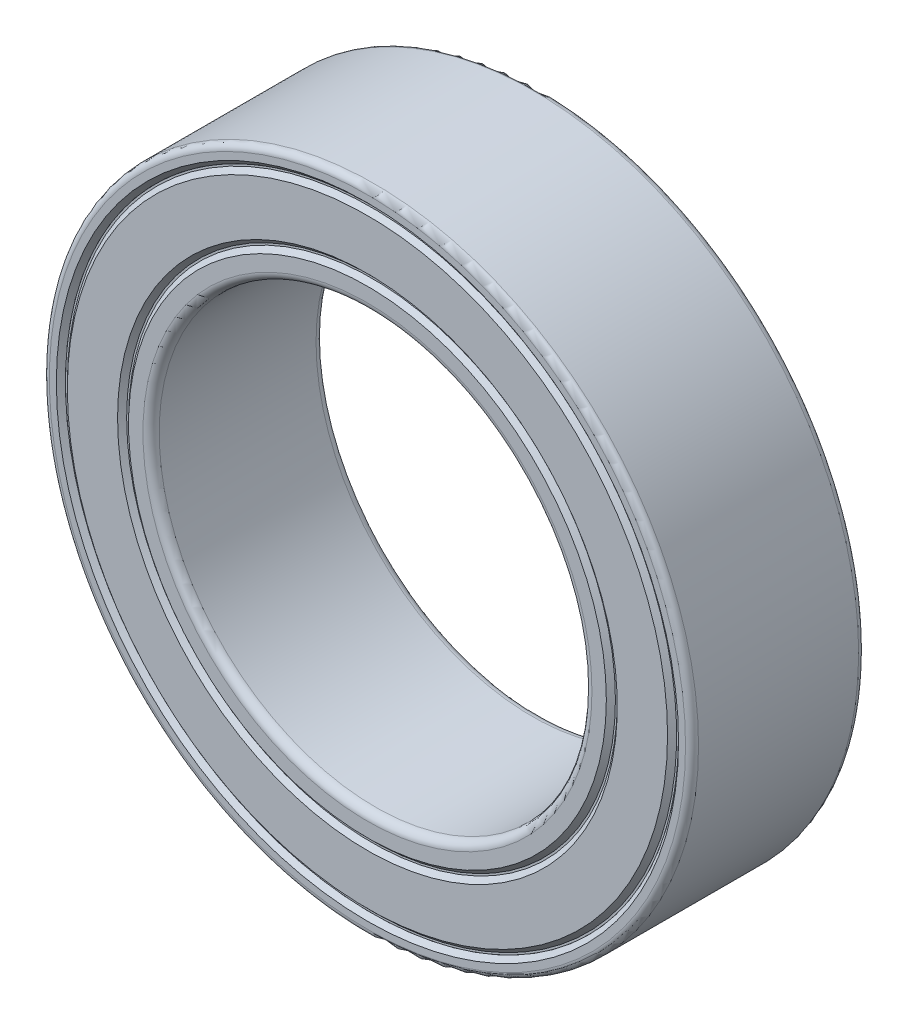
ISO-10303-21;
HEADER;
FILE_DESCRIPTION(('STEP AP214'),'2;1');
FILE_NAME('part.step','',(''),(''),'','','');
FILE_SCHEMA(('AUTOMOTIVE_DESIGN { 1 0 10303 214 1 1 1 1 }'));
ENDSEC;
DATA;
#1=APPLICATION_CONTEXT('core data for automotive mechanical design processes');
#2=APPLICATION_PROTOCOL_DEFINITION('international standard','automotive_design',2000,#1);
#3=PRODUCT_CONTEXT('',#1,'mechanical');
#4=PRODUCT('Part','Part','',(#3));
#5=PRODUCT_RELATED_PRODUCT_CATEGORY('part','',(#4));
#6=PRODUCT_DEFINITION_FORMATION('','',#4);
#7=PRODUCT_DEFINITION_CONTEXT('part definition',#1,'design');
#8=PRODUCT_DEFINITION('design','',#6,#7);
#9=PRODUCT_DEFINITION_SHAPE('','',#8);
#10=(LENGTH_UNIT() NAMED_UNIT(*) SI_UNIT(.MILLI.,.METRE.));
#11=(NAMED_UNIT(*) PLANE_ANGLE_UNIT() SI_UNIT($,.RADIAN.));
#12=(NAMED_UNIT(*) SI_UNIT($,.STERADIAN.) SOLID_ANGLE_UNIT());
#13=UNCERTAINTY_MEASURE_WITH_UNIT(LENGTH_MEASURE(1.E-05),#10,'distance_accuracy_value','');
#14=(GEOMETRIC_REPRESENTATION_CONTEXT(3) GLOBAL_UNCERTAINTY_ASSIGNED_CONTEXT((#13)) GLOBAL_UNIT_ASSIGNED_CONTEXT((#10,
#11,#12)) REPRESENTATION_CONTEXT('',''));
#15=CARTESIAN_POINT('',(0.,0.,0.));
#16=DIRECTION('',(0.,0.,1.));
#17=DIRECTION('',(1.,0.,0.));
#18=AXIS2_PLACEMENT_3D('',#15,#16,#17);
#19=CARTESIAN_POINT('',(0.,0.,-1.895));
#20=DIRECTION('',(0.,0.,-1.));
#21=DIRECTION('',(1.,0.,0.));
#22=AXIS2_PLACEMENT_3D('',#19,#20,#21);
#23=CYLINDRICAL_SURFACE('',#22,5.625);
#24=CARTESIAN_POINT('',(0.,0.,-1.895));
#25=DIRECTION('',(0.,0.,-1.));
#26=DIRECTION('',(-1.,0.,0.));
#27=AXIS2_PLACEMENT_3D('',#24,#25,#26);
#28=CIRCLE('',#27,5.625);
#29=CARTESIAN_POINT('',(-5.625,0.,-1.895));
#30=VERTEX_POINT('',#29);
#31=EDGE_CURVE('E77',#30,#30,#28,.T.);
#32=ORIENTED_EDGE('',*,*,#31,.T.);
#33=EDGE_LOOP('',(#32));
#34=FACE_BOUND('',#33,.T.);
#35=CARTESIAN_POINT('',(0.,0.,-1.768));
#36=DIRECTION('',(0.,0.,-1.));
#37=DIRECTION('',(-1.,0.,0.));
#38=AXIS2_PLACEMENT_3D('',#35,#36,#37);
#39=CIRCLE('',#38,5.625);
#40=CARTESIAN_POINT('',(-5.625,0.,-1.768));
#41=VERTEX_POINT('',#40);
#42=EDGE_CURVE('E46',#41,#41,#39,.T.);
#43=ORIENTED_EDGE('',*,*,#42,.F.);
#44=EDGE_LOOP('',(#43));
#45=FACE_BOUND('',#44,.T.);
#46=ADVANCED_FACE('F43',(#34,#45),#23,.F.);
#47=CARTESIAN_POINT('',(0.,0.,-1.895));
#48=DIRECTION('',(0.,0.,-1.));
#49=DIRECTION('',(1.,0.,0.));
#50=AXIS2_PLACEMENT_3D('',#47,#48,#49);
#51=CYLINDRICAL_SURFACE('',#50,7.08333333333333);
#52=CARTESIAN_POINT('',(0.,0.,-1.895));
#53=DIRECTION('',(0.,0.,-1.));
#54=DIRECTION('',(-1.,0.,0.));
#55=AXIS2_PLACEMENT_3D('',#52,#53,#54);
#56=CIRCLE('',#55,7.08333333333333);
#57=CARTESIAN_POINT('',(-7.08333333333333,0.,-1.895));
#58=VERTEX_POINT('',#57);
#59=EDGE_CURVE('E11',#58,#58,#56,.T.);
#60=ORIENTED_EDGE('',*,*,#59,.F.);
#61=EDGE_LOOP('',(#60));
#62=FACE_BOUND('',#61,.T.);
#63=CARTESIAN_POINT('',(0.,0.,-1.768));
#64=DIRECTION('',(0.,0.,-1.));
#65=DIRECTION('',(-1.,0.,0.));
#66=AXIS2_PLACEMENT_3D('',#63,#64,#65);
#67=CIRCLE('',#66,7.08333333333333);
#68=CARTESIAN_POINT('',(-7.08333333333333,0.,-1.768));
#69=VERTEX_POINT('',#68);
#70=EDGE_CURVE('E63',#69,#69,#67,.T.);
#71=ORIENTED_EDGE('',*,*,#70,.T.);
#72=EDGE_LOOP('',(#71));
#73=FACE_BOUND('',#72,.T.);
#74=ADVANCED_FACE('F100',(#62,#73),#51,.T.);
#75=CARTESIAN_POINT('',(0.,-7.03958333333333,-1.895));
#76=DIRECTION('',(0.,0.,-1.));
#77=DIRECTION('',(1.,0.,0.));
#78=AXIS2_PLACEMENT_3D('',#75,#76,#77);
#79=PLANE('',#78);
#80=CARTESIAN_POINT('',(0.,0.,-1.895));
#81=DIRECTION('',(0.,0.,-1.));
#82=DIRECTION('',(-1.,0.,0.));
#83=AXIS2_PLACEMENT_3D('',#80,#81,#82);
#84=CIRCLE('',#83,7.03958333333333);
#85=CARTESIAN_POINT('',(-7.03958333333333,0.,-1.895));
#86=VERTEX_POINT('',#85);
#87=EDGE_CURVE('E50',#86,#86,#84,.T.);
#88=ORIENTED_EDGE('',*,*,#87,.F.);
#89=EDGE_LOOP('',(#88));
#90=FACE_BOUND('',#89,.T.);
#91=ORIENTED_EDGE('',*,*,#59,.T.);
#92=EDGE_LOOP('',(#91));
#93=FACE_BOUND('',#92,.T.);
#94=ADVANCED_FACE('F95',(#90,#93),#79,.T.);
#95=CARTESIAN_POINT('',(0.,0.,-1.895));
#96=DIRECTION('',(0.,0.,1.));
#97=DIRECTION('',(-1.,0.,0.));
#98=AXIS2_PLACEMENT_3D('',#95,#96,#97);
#99=CONICAL_SURFACE('',#98,7.03958333333333,0.785398163397448);
#100=CARTESIAN_POINT('',(0.,0.,-2.));
#101=DIRECTION('',(0.,0.,-1.));
#102=DIRECTION('',(-1.,0.,0.));
#103=AXIS2_PLACEMENT_3D('',#100,#101,#102);
#104=CIRCLE('',#103,6.93458333333333);
#105=CARTESIAN_POINT('',(-6.93458333333333,0.,-2.));
#106=VERTEX_POINT('',#105);
#107=EDGE_CURVE('E55',#106,#106,#104,.T.);
#108=ORIENTED_EDGE('',*,*,#107,.F.);
#109=EDGE_LOOP('',(#108));
#110=FACE_BOUND('',#109,.T.);
#111=ORIENTED_EDGE('',*,*,#87,.T.);
#112=EDGE_LOOP('',(#111));
#113=FACE_BOUND('',#112,.T.);
#114=ADVANCED_FACE('F92',(#110,#113),#99,.T.);
#115=CARTESIAN_POINT('',(0.,-5.77375000000001,-2.));
#116=DIRECTION('',(0.,0.,-1.));
#117=DIRECTION('',(1.,0.,0.));
#118=AXIS2_PLACEMENT_3D('',#115,#116,#117);
#119=PLANE('',#118);
#120=CARTESIAN_POINT('',(0.,0.,-2.));
#121=DIRECTION('',(0.,0.,-1.));
#122=DIRECTION('',(-1.,0.,0.));
#123=AXIS2_PLACEMENT_3D('',#120,#121,#122);
#124=CIRCLE('',#123,5.77375000000001);
#125=CARTESIAN_POINT('',(-5.77375000000001,0.,-2.));
#126=VERTEX_POINT('',#125);
#127=EDGE_CURVE('E82',#126,#126,#124,.T.);
#128=ORIENTED_EDGE('',*,*,#127,.F.);
#129=EDGE_LOOP('',(#128));
#130=FACE_BOUND('',#129,.T.);
#131=ORIENTED_EDGE('',*,*,#107,.T.);
#132=EDGE_LOOP('',(#131));
#133=FACE_BOUND('',#132,.T.);
#134=ADVANCED_FACE('F90',(#130,#133),#119,.T.);
#135=CARTESIAN_POINT('',(0.,0.,-2.));
#136=DIRECTION('',(0.,0.,-1.));
#137=DIRECTION('',(1.,0.,0.));
#138=AXIS2_PLACEMENT_3D('',#135,#136,#137);
#139=CONICAL_SURFACE('',#138,5.77375000000001,0.785398163397457);
#140=CARTESIAN_POINT('',(0.,0.,-1.895));
#141=DIRECTION('',(0.,0.,-1.));
#142=DIRECTION('',(-1.,0.,0.));
#143=AXIS2_PLACEMENT_3D('',#140,#141,#142);
#144=CIRCLE('',#143,5.66875);
#145=CARTESIAN_POINT('',(-5.66875,0.,-1.895));
#146=VERTEX_POINT('',#145);
#147=EDGE_CURVE('E73',#146,#146,#144,.T.);
#148=ORIENTED_EDGE('',*,*,#147,.F.);
#149=EDGE_LOOP('',(#148));
#150=FACE_BOUND('',#149,.T.);
#151=ORIENTED_EDGE('',*,*,#127,.T.);
#152=EDGE_LOOP('',(#151));
#153=FACE_BOUND('',#152,.T.);
#154=ADVANCED_FACE('F147',(#150,#153),#139,.F.);
#155=CARTESIAN_POINT('',(0.,-5.66875,-1.895));
#156=DIRECTION('',(0.,0.,-1.));
#157=DIRECTION('',(1.,0.,0.));
#158=AXIS2_PLACEMENT_3D('',#155,#156,#157);
#159=PLANE('',#158);
#160=ORIENTED_EDGE('',*,*,#31,.F.);
#161=EDGE_LOOP('',(#160));
#162=FACE_BOUND('',#161,.T.);
#163=ORIENTED_EDGE('',*,*,#147,.T.);
#164=EDGE_LOOP('',(#163));
#165=FACE_BOUND('',#164,.T.);
#166=ADVANCED_FACE('F143',(#162,#165),#159,.T.);
#167=CARTESIAN_POINT('',(0.,-7.03958333333333,-1.768));
#168=DIRECTION('',(0.,0.,-1.));
#169=DIRECTION('',(1.,0.,0.));
#170=AXIS2_PLACEMENT_3D('',#167,#168,#169);
#171=PLANE('',#170);
#172=CARTESIAN_POINT('',(0.,0.,-1.768));
#173=DIRECTION('',(0.,0.,1.));
#174=DIRECTION('',(1.,0.,0.));
#175=AXIS2_PLACEMENT_3D('',#172,#173,#174);
#176=CIRCLE('',#175,6.98697821091195);
#177=CARTESIAN_POINT('',(6.98697821091195,0.,-1.768));
#178=VERTEX_POINT('',#177);
#179=EDGE_CURVE('E60',#178,#178,#176,.F.);
#180=ORIENTED_EDGE('',*,*,#179,.T.);
#181=EDGE_LOOP('',(#180));
#182=FACE_BOUND('',#181,.T.);
#183=ORIENTED_EDGE('',*,*,#70,.F.);
#184=EDGE_LOOP('',(#183));
#185=FACE_BOUND('',#184,.T.);
#186=ADVANCED_FACE('F137',(#182,#185),#171,.F.);
#187=CARTESIAN_POINT('',(0.,0.,-1.8051974387893));
#188=DIRECTION('',(0.,0.,1.));
#189=DIRECTION('',(-1.,0.,0.));
#190=AXIS2_PLACEMENT_3D('',#187,#188,#189);
#191=CONICAL_SURFACE('',#190,6.94978077212264,0.785398163397448);
#192=CARTESIAN_POINT('',(0.,0.,-1.873));
#193=DIRECTION('',(0.,0.,1.));
#194=DIRECTION('',(1.,0.,0.));
#195=AXIS2_PLACEMENT_3D('',#192,#193,#194);
#196=CIRCLE('',#195,6.88197821091194);
#197=CARTESIAN_POINT('',(6.88197821091194,0.,-1.873));
#198=VERTEX_POINT('',#197);
#199=EDGE_CURVE('E64',#198,#198,#196,.F.);
#200=ORIENTED_EDGE('',*,*,#199,.T.);
#201=EDGE_LOOP('',(#200));
#202=FACE_BOUND('',#201,.T.);
#203=ORIENTED_EDGE('',*,*,#179,.F.);
#204=EDGE_LOOP('',(#203));
#205=FACE_BOUND('',#204,.T.);
#206=ADVANCED_FACE('F131',(#202,#205),#191,.F.);
#207=CARTESIAN_POINT('',(0.,-5.77375000000001,-1.873));
#208=DIRECTION('',(0.,0.,-1.));
#209=DIRECTION('',(1.,0.,0.));
#210=AXIS2_PLACEMENT_3D('',#207,#208,#209);
#211=PLANE('',#210);
#212=CARTESIAN_POINT('',(0.,0.,-1.873));
#213=DIRECTION('',(0.,0.,1.));
#214=DIRECTION('',(1.,0.,0.));
#215=AXIS2_PLACEMENT_3D('',#212,#213,#214);
#216=CIRCLE('',#215,5.82635512242139);
#217=CARTESIAN_POINT('',(5.82635512242139,0.,-1.873));
#218=VERTEX_POINT('',#217);
#219=EDGE_CURVE('E67',#218,#218,#216,.F.);
#220=ORIENTED_EDGE('',*,*,#219,.T.);
#221=EDGE_LOOP('',(#220));
#222=FACE_BOUND('',#221,.T.);
#223=ORIENTED_EDGE('',*,*,#199,.F.);
#224=EDGE_LOOP('',(#223));
#225=FACE_BOUND('',#224,.T.);
#226=ADVANCED_FACE('F125',(#222,#225),#211,.F.);
#227=CARTESIAN_POINT('',(0.,0.,-1.91019743878931));
#228=DIRECTION('',(0.,0.,-1.));
#229=DIRECTION('',(1.,0.,0.));
#230=AXIS2_PLACEMENT_3D('',#227,#228,#229);
#231=CONICAL_SURFACE('',#230,5.8635525612107,0.785398163397457);
#232=CARTESIAN_POINT('',(0.,0.,-1.768));
#233=DIRECTION('',(0.,0.,1.));
#234=DIRECTION('',(1.,0.,0.));
#235=AXIS2_PLACEMENT_3D('',#232,#233,#234);
#236=CIRCLE('',#235,5.72135512242138);
#237=CARTESIAN_POINT('',(5.72135512242138,0.,-1.768));
#238=VERTEX_POINT('',#237);
#239=EDGE_CURVE('E70',#238,#238,#236,.F.);
#240=ORIENTED_EDGE('',*,*,#239,.T.);
#241=EDGE_LOOP('',(#240));
#242=FACE_BOUND('',#241,.T.);
#243=ORIENTED_EDGE('',*,*,#219,.F.);
#244=EDGE_LOOP('',(#243));
#245=FACE_BOUND('',#244,.T.);
#246=ADVANCED_FACE('F119',(#242,#245),#231,.T.);
#247=CARTESIAN_POINT('',(0.,-5.66875,-1.768));
#248=DIRECTION('',(0.,0.,-1.));
#249=DIRECTION('',(1.,0.,0.));
#250=AXIS2_PLACEMENT_3D('',#247,#248,#249);
#251=PLANE('',#250);
#252=ORIENTED_EDGE('',*,*,#42,.T.);
#253=EDGE_LOOP('',(#252));
#254=FACE_BOUND('',#253,.T.);
#255=ORIENTED_EDGE('',*,*,#239,.F.);
#256=EDGE_LOOP('',(#255));
#257=FACE_BOUND('',#256,.T.);
#258=ADVANCED_FACE('F116',(#254,#257),#251,.F.);
#259=CLOSED_SHELL('',(#46,#74,#94,#114,#134,#154,#166,#186,#206,#226,#246,#258));
#260=MANIFOLD_SOLID_BREP('B2',#259);
#261=CARTESIAN_POINT('',(0.,0.,1.895));
#262=DIRECTION('',(0.,0.,1.));
#263=DIRECTION('',(1.,0.,0.));
#264=AXIS2_PLACEMENT_3D('',#261,#262,#263);
#265=CYLINDRICAL_SURFACE('',#264,5.625);
#266=CARTESIAN_POINT('',(0.,0.,1.895));
#267=DIRECTION('',(0.,0.,-1.));
#268=DIRECTION('',(-1.,0.,0.));
#269=AXIS2_PLACEMENT_3D('',#266,#267,#268);
#270=CIRCLE('',#269,5.625);
#271=CARTESIAN_POINT('',(-5.625,0.,1.895));
#272=VERTEX_POINT('',#271);
#273=EDGE_CURVE('E264',#272,#272,#270,.T.);
#274=ORIENTED_EDGE('',*,*,#273,.F.);
#275=EDGE_LOOP('',(#274));
#276=FACE_BOUND('',#275,.T.);
#277=CARTESIAN_POINT('',(0.,0.,1.768));
#278=DIRECTION('',(0.,0.,-1.));
#279=DIRECTION('',(-1.,0.,0.));
#280=AXIS2_PLACEMENT_3D('',#277,#278,#279);
#281=CIRCLE('',#280,5.625);
#282=CARTESIAN_POINT('',(-5.625,0.,1.768));
#283=VERTEX_POINT('',#282);
#284=EDGE_CURVE('E233',#283,#283,#281,.T.);
#285=ORIENTED_EDGE('',*,*,#284,.T.);
#286=EDGE_LOOP('',(#285));
#287=FACE_BOUND('',#286,.T.);
#288=ADVANCED_FACE('F230',(#276,#287),#265,.F.);
#289=CARTESIAN_POINT('',(0.,0.,1.895));
#290=DIRECTION('',(0.,0.,1.));
#291=DIRECTION('',(1.,0.,0.));
#292=AXIS2_PLACEMENT_3D('',#289,#290,#291);
#293=CYLINDRICAL_SURFACE('',#292,7.08333333333333);
#294=CARTESIAN_POINT('',(0.,0.,1.895));
#295=DIRECTION('',(0.,0.,-1.));
#296=DIRECTION('',(-1.,0.,0.));
#297=AXIS2_PLACEMENT_3D('',#294,#295,#296);
#298=CIRCLE('',#297,7.08333333333333);
#299=CARTESIAN_POINT('',(-7.08333333333333,0.,1.895));
#300=VERTEX_POINT('',#299);
#301=EDGE_CURVE('E42',#300,#300,#298,.T.);
#302=ORIENTED_EDGE('',*,*,#301,.T.);
#303=EDGE_LOOP('',(#302));
#304=FACE_BOUND('',#303,.T.);
#305=CARTESIAN_POINT('',(0.,0.,1.768));
#306=DIRECTION('',(0.,0.,-1.));
#307=DIRECTION('',(-1.,0.,0.));
#308=AXIS2_PLACEMENT_3D('',#305,#306,#307);
#309=CIRCLE('',#308,7.08333333333333);
#310=CARTESIAN_POINT('',(-7.08333333333333,0.,1.768));
#311=VERTEX_POINT('',#310);
#312=EDGE_CURVE('E250',#311,#311,#309,.T.);
#313=ORIENTED_EDGE('',*,*,#312,.F.);
#314=EDGE_LOOP('',(#313));
#315=FACE_BOUND('',#314,.T.);
#316=ADVANCED_FACE('F293',(#304,#315),#293,.T.);
#317=CARTESIAN_POINT('',(0.,-7.03958333333333,1.895));
#318=DIRECTION('',(0.,0.,1.));
#319=DIRECTION('',(1.,0.,0.));
#320=AXIS2_PLACEMENT_3D('',#317,#318,#319);
#321=PLANE('',#320);
#322=CARTESIAN_POINT('',(0.,0.,1.895));
#323=DIRECTION('',(0.,0.,-1.));
#324=DIRECTION('',(-1.,0.,0.));
#325=AXIS2_PLACEMENT_3D('',#322,#323,#324);
#326=CIRCLE('',#325,7.03958333333333);
#327=CARTESIAN_POINT('',(-7.03958333333333,0.,1.895));
#328=VERTEX_POINT('',#327);
#329=EDGE_CURVE('E237',#328,#328,#326,.T.);
#330=ORIENTED_EDGE('',*,*,#329,.T.);
#331=EDGE_LOOP('',(#330));
#332=FACE_BOUND('',#331,.T.);
#333=ORIENTED_EDGE('',*,*,#301,.F.);
#334=EDGE_LOOP('',(#333));
#335=FACE_BOUND('',#334,.T.);
#336=ADVANCED_FACE('F290',(#332,#335),#321,.T.);
#337=CARTESIAN_POINT('',(0.,0.,1.895));
#338=DIRECTION('',(0.,0.,-1.));
#339=DIRECTION('',(-1.,0.,0.));
#340=AXIS2_PLACEMENT_3D('',#337,#338,#339);
#341=CONICAL_SURFACE('',#340,7.03958333333333,0.785398163397448);
#342=CARTESIAN_POINT('',(0.,0.,2.));
#343=DIRECTION('',(0.,0.,-1.));
#344=DIRECTION('',(-1.,0.,0.));
#345=AXIS2_PLACEMENT_3D('',#342,#343,#344);
#346=CIRCLE('',#345,6.93458333333333);
#347=CARTESIAN_POINT('',(-6.93458333333333,0.,2.));
#348=VERTEX_POINT('',#347);
#349=EDGE_CURVE('E242',#348,#348,#346,.T.);
#350=ORIENTED_EDGE('',*,*,#349,.T.);
#351=EDGE_LOOP('',(#350));
#352=FACE_BOUND('',#351,.T.);
#353=ORIENTED_EDGE('',*,*,#329,.F.);
#354=EDGE_LOOP('',(#353));
#355=FACE_BOUND('',#354,.T.);
#356=ADVANCED_FACE('F277',(#352,#355),#341,.T.);
#357=CARTESIAN_POINT('',(0.,-5.77375000000001,2.));
#358=DIRECTION('',(0.,0.,1.));
#359=DIRECTION('',(1.,0.,0.));
#360=AXIS2_PLACEMENT_3D('',#357,#358,#359);
#361=PLANE('',#360);
#362=CARTESIAN_POINT('',(0.,0.,2.));
#363=DIRECTION('',(0.,0.,-1.));
#364=DIRECTION('',(-1.,0.,0.));
#365=AXIS2_PLACEMENT_3D('',#362,#363,#364);
#366=CIRCLE('',#365,5.77375000000001);
#367=CARTESIAN_POINT('',(-5.77375000000001,0.,2.));
#368=VERTEX_POINT('',#367);
#369=EDGE_CURVE('E269',#368,#368,#366,.T.);
#370=ORIENTED_EDGE('',*,*,#369,.T.);
#371=EDGE_LOOP('',(#370));
#372=FACE_BOUND('',#371,.T.);
#373=ORIENTED_EDGE('',*,*,#349,.F.);
#374=EDGE_LOOP('',(#373));
#375=FACE_BOUND('',#374,.T.);
#376=ADVANCED_FACE('F280',(#372,#375),#361,.T.);
#377=CARTESIAN_POINT('',(0.,0.,2.));
#378=DIRECTION('',(0.,0.,1.));
#379=DIRECTION('',(1.,0.,0.));
#380=AXIS2_PLACEMENT_3D('',#377,#378,#379);
#381=CONICAL_SURFACE('',#380,5.77375000000001,0.785398163397457);
#382=CARTESIAN_POINT('',(0.,0.,1.895));
#383=DIRECTION('',(0.,0.,-1.));
#384=DIRECTION('',(-1.,0.,0.));
#385=AXIS2_PLACEMENT_3D('',#382,#383,#384);
#386=CIRCLE('',#385,5.66875);
#387=CARTESIAN_POINT('',(-5.66875,0.,1.895));
#388=VERTEX_POINT('',#387);
#389=EDGE_CURVE('E260',#388,#388,#386,.T.);
#390=ORIENTED_EDGE('',*,*,#389,.T.);
#391=EDGE_LOOP('',(#390));
#392=FACE_BOUND('',#391,.T.);
#393=ORIENTED_EDGE('',*,*,#369,.F.);
#394=EDGE_LOOP('',(#393));
#395=FACE_BOUND('',#394,.T.);
#396=ADVANCED_FACE('F282',(#392,#395),#381,.F.);
#397=CARTESIAN_POINT('',(0.,-5.66875,1.895));
#398=DIRECTION('',(0.,0.,1.));
#399=DIRECTION('',(1.,0.,0.));
#400=AXIS2_PLACEMENT_3D('',#397,#398,#399);
#401=PLANE('',#400);
#402=ORIENTED_EDGE('',*,*,#273,.T.);
#403=EDGE_LOOP('',(#402));
#404=FACE_BOUND('',#403,.T.);
#405=ORIENTED_EDGE('',*,*,#389,.F.);
#406=EDGE_LOOP('',(#405));
#407=FACE_BOUND('',#406,.T.);
#408=ADVANCED_FACE('F288',(#404,#407),#401,.T.);
#409=CARTESIAN_POINT('',(0.,-7.03958333333333,1.768));
#410=DIRECTION('',(0.,0.,1.));
#411=DIRECTION('',(1.,0.,0.));
#412=AXIS2_PLACEMENT_3D('',#409,#410,#411);
#413=PLANE('',#412);
#414=CARTESIAN_POINT('',(0.,0.,1.768));
#415=DIRECTION('',(0.,0.,1.));
#416=DIRECTION('',(1.,0.,0.));
#417=AXIS2_PLACEMENT_3D('',#414,#415,#416);
#418=CIRCLE('',#417,6.98697821091195);
#419=CARTESIAN_POINT('',(6.98697821091195,0.,1.768));
#420=VERTEX_POINT('',#419);
#421=EDGE_CURVE('E247',#420,#420,#418,.F.);
#422=ORIENTED_EDGE('',*,*,#421,.F.);
#423=EDGE_LOOP('',(#422));
#424=FACE_BOUND('',#423,.T.);
#425=ORIENTED_EDGE('',*,*,#312,.T.);
#426=EDGE_LOOP('',(#425));
#427=FACE_BOUND('',#426,.T.);
#428=ADVANCED_FACE('F324',(#424,#427),#413,.F.);
#429=CARTESIAN_POINT('',(0.,0.,1.8051974387893));
#430=DIRECTION('',(0.,0.,-1.));
#431=DIRECTION('',(-1.,0.,0.));
#432=AXIS2_PLACEMENT_3D('',#429,#430,#431);
#433=CONICAL_SURFACE('',#432,6.94978077212264,0.785398163397448);
#434=CARTESIAN_POINT('',(0.,0.,1.873));
#435=DIRECTION('',(0.,0.,1.));
#436=DIRECTION('',(1.,0.,0.));
#437=AXIS2_PLACEMENT_3D('',#434,#435,#436);
#438=CIRCLE('',#437,6.88197821091194);
#439=CARTESIAN_POINT('',(6.88197821091194,0.,1.873));
#440=VERTEX_POINT('',#439);
#441=EDGE_CURVE('E251',#440,#440,#438,.F.);
#442=ORIENTED_EDGE('',*,*,#441,.F.);
#443=EDGE_LOOP('',(#442));
#444=FACE_BOUND('',#443,.T.);
#445=ORIENTED_EDGE('',*,*,#421,.T.);
#446=EDGE_LOOP('',(#445));
#447=FACE_BOUND('',#446,.T.);
#448=ADVANCED_FACE('F318',(#444,#447),#433,.F.);
#449=CARTESIAN_POINT('',(0.,-5.77375000000001,1.873));
#450=DIRECTION('',(0.,0.,1.));
#451=DIRECTION('',(1.,0.,0.));
#452=AXIS2_PLACEMENT_3D('',#449,#450,#451);
#453=PLANE('',#452);
#454=CARTESIAN_POINT('',(0.,0.,1.873));
#455=DIRECTION('',(0.,0.,1.));
#456=DIRECTION('',(1.,0.,0.));
#457=AXIS2_PLACEMENT_3D('',#454,#455,#456);
#458=CIRCLE('',#457,5.82635512242139);
#459=CARTESIAN_POINT('',(5.82635512242139,0.,1.873));
#460=VERTEX_POINT('',#459);
#461=EDGE_CURVE('E254',#460,#460,#458,.F.);
#462=ORIENTED_EDGE('',*,*,#461,.F.);
#463=EDGE_LOOP('',(#462));
#464=FACE_BOUND('',#463,.T.);
#465=ORIENTED_EDGE('',*,*,#441,.T.);
#466=EDGE_LOOP('',(#465));
#467=FACE_BOUND('',#466,.T.);
#468=ADVANCED_FACE('F312',(#464,#467),#453,.F.);
#469=CARTESIAN_POINT('',(0.,0.,1.91019743878931));
#470=DIRECTION('',(0.,0.,1.));
#471=DIRECTION('',(1.,0.,0.));
#472=AXIS2_PLACEMENT_3D('',#469,#470,#471);
#473=CONICAL_SURFACE('',#472,5.8635525612107,0.785398163397457);
#474=CARTESIAN_POINT('',(0.,0.,1.768));
#475=DIRECTION('',(0.,0.,1.));
#476=DIRECTION('',(1.,0.,0.));
#477=AXIS2_PLACEMENT_3D('',#474,#475,#476);
#478=CIRCLE('',#477,5.72135512242138);
#479=CARTESIAN_POINT('',(5.72135512242138,0.,1.768));
#480=VERTEX_POINT('',#479);
#481=EDGE_CURVE('E257',#480,#480,#478,.F.);
#482=ORIENTED_EDGE('',*,*,#481,.F.);
#483=EDGE_LOOP('',(#482));
#484=FACE_BOUND('',#483,.T.);
#485=ORIENTED_EDGE('',*,*,#461,.T.);
#486=EDGE_LOOP('',(#485));
#487=FACE_BOUND('',#486,.T.);
#488=ADVANCED_FACE('F306',(#484,#487),#473,.T.);
#489=CARTESIAN_POINT('',(0.,-5.66875,1.768));
#490=DIRECTION('',(0.,0.,1.));
#491=DIRECTION('',(1.,0.,0.));
#492=AXIS2_PLACEMENT_3D('',#489,#490,#491);
#493=PLANE('',#492);
#494=ORIENTED_EDGE('',*,*,#284,.F.);
#495=EDGE_LOOP('',(#494));
#496=FACE_BOUND('',#495,.T.);
#497=ORIENTED_EDGE('',*,*,#481,.T.);
#498=EDGE_LOOP('',(#497));
#499=FACE_BOUND('',#498,.T.);
#500=ADVANCED_FACE('F303',(#496,#499),#493,.F.);
#501=CLOSED_SHELL('',(#288,#316,#336,#356,#376,#396,#408,#428,#448,#468,#488,#500));
#502=MANIFOLD_SOLID_BREP('B6',#501);
#503=CARTESIAN_POINT('',(4.96788754484889,-3.96175811597743,0.));
#504=DIRECTION('',(-0.781831482468022,0.623489801858743,0.));
#505=DIRECTION('',(0.,0.,-1.));
#506=AXIS2_PLACEMENT_3D('',#503,#504,#505);
#507=SPHERICAL_SURFACE('',#506,0.875000000000001);
#508=CARTESIAN_POINT('',(4.28378499768937,-3.41620453935103,0.));
#509=VERTEX_POINT('',#508);
#510=VERTEX_LOOP('',#509);
#511=FACE_BOUND('',#510,.T.);
#512=ADVANCED_FACE('F417',(#511),#507,.T.);
#513=CLOSED_SHELL('',(#512));
#514=MANIFOLD_SOLID_BREP('B37',#513);
#515=CARTESIAN_POINT('',(6.19485444198869,1.41393510118069,0.));
#516=DIRECTION('',(-0.974927912181826,-0.222520933956305,0.));
#517=DIRECTION('',(0.,0.,-1.));
#518=AXIS2_PLACEMENT_3D('',#515,#516,#517);
#519=SPHERICAL_SURFACE('',#518,0.875000000000001);
#520=CARTESIAN_POINT('',(5.34179251882959,1.21922928396892,0.));
#521=VERTEX_POINT('',#520);
#522=VERTEX_LOOP('',#521);
#523=FACE_BOUND('',#522,.T.);
#524=ADVANCED_FACE('F435',(#523),#519,.T.);
#525=CLOSED_SHELL('',(#524));
#526=MANIFOLD_SOLID_BREP('B226',#525);
#527=CARTESIAN_POINT('',(2.75696959230953,5.72490634812993,0.));
#528=DIRECTION('',(-0.433883739117565,-0.900968867902416,0.));
#529=DIRECTION('',(0.,0.,-1.));
#530=AXIS2_PLACEMENT_3D('',#527,#528,#529);
#531=SPHERICAL_SURFACE('',#530,0.875000000000001);
#532=CARTESIAN_POINT('',(2.37732132058166,4.93655858871532,0.));
#533=VERTEX_POINT('',#532);
#534=VERTEX_LOOP('',#533);
#535=FACE_BOUND('',#534,.T.);
#536=ADVANCED_FACE('F453',(#535),#531,.T.);
#537=CLOSED_SHELL('',(#536));
#538=MANIFOLD_SOLID_BREP('B413',#537);
#539=CARTESIAN_POINT('',(-2.75696959230945,5.72490634812997,0.));
#540=DIRECTION('',(0.433883739117553,-0.900968867902422,0.));
#541=DIRECTION('',(0.,0.,-1.));
#542=AXIS2_PLACEMENT_3D('',#539,#540,#541);
#543=SPHERICAL_SURFACE('',#542,0.875000000000001);
#544=CARTESIAN_POINT('',(-2.37732132058159,4.93655858871535,0.));
#545=VERTEX_POINT('',#544);
#546=VERTEX_LOOP('',#545);
#547=FACE_BOUND('',#546,.T.);
#548=ADVANCED_FACE('F471',(#547),#543,.T.);
#549=CLOSED_SHELL('',(#548));
#550=MANIFOLD_SOLID_BREP('B431',#549);
#551=CARTESIAN_POINT('',(-6.19485444198867,1.41393510118077,0.));
#552=DIRECTION('',(0.974927912181823,-0.222520933956318,0.));
#553=DIRECTION('',(0.,0.,-1.));
#554=AXIS2_PLACEMENT_3D('',#551,#552,#553);
#555=SPHERICAL_SURFACE('',#554,0.875000000000001);
#556=CARTESIAN_POINT('',(-5.34179251882957,1.21922928396899,0.));
#557=VERTEX_POINT('',#556);
#558=VERTEX_LOOP('',#557);
#559=FACE_BOUND('',#558,.T.);
#560=ADVANCED_FACE('F489',(#559),#555,.T.);
#561=CLOSED_SHELL('',(#560));
#562=MANIFOLD_SOLID_BREP('B449',#561);
#563=CARTESIAN_POINT('',(-4.96788754484895,-3.96175811597736,0.));
#564=DIRECTION('',(0.781831482468031,0.623489801858732,0.));
#565=DIRECTION('',(0.,0.,-1.));
#566=AXIS2_PLACEMENT_3D('',#563,#564,#565);
#567=SPHERICAL_SURFACE('',#566,0.875000000000001);
#568=CARTESIAN_POINT('',(-4.28378499768942,-3.41620453935097,0.));
#569=VERTEX_POINT('',#568);
#570=VERTEX_LOOP('',#569);
#571=FACE_BOUND('',#570,.T.);
#572=ADVANCED_FACE('F507',(#571),#567,.T.);
#573=CLOSED_SHELL('',(#572));
#574=MANIFOLD_SOLID_BREP('B467',#573);
#575=CARTESIAN_POINT('',(0.,-6.35416666666667,0.));
#576=DIRECTION('',(0.,1.,0.));
#577=DIRECTION('',(0.,0.,-1.));
#578=AXIS2_PLACEMENT_3D('',#575,#576,#577);
#579=SPHERICAL_SURFACE('',#578,0.875000000000001);
#580=CARTESIAN_POINT('',(0.,-5.47916666666667,0.));
#581=VERTEX_POINT('',#580);
#582=VERTEX_LOOP('',#581);
#583=FACE_BOUND('',#582,.T.);
#584=ADVANCED_FACE('F527',(#583),#579,.T.);
#585=CLOSED_SHELL('',(#584));
#586=MANIFOLD_SOLID_BREP('B485',#585);
#587=CARTESIAN_POINT('',(0.,0.,2.));
#588=DIRECTION('',(0.,0.,1.));
#589=DIRECTION('',(1.,0.,0.));
#590=AXIS2_PLACEMENT_3D('',#587,#588,#589);
#591=CYLINDRICAL_SURFACE('',#590,5.625);
#592=CARTESIAN_POINT('',(0.,0.,1.895));
#593=DIRECTION('',(0.,0.,1.));
#594=DIRECTION('',(1.,0.,0.));
#595=AXIS2_PLACEMENT_3D('',#592,#593,#594);
#596=CIRCLE('',#595,5.625);
#597=CARTESIAN_POINT('',(5.625,0.,1.895));
#598=VERTEX_POINT('',#597);
#599=EDGE_CURVE('E526',#598,#598,#596,.F.);
#600=ORIENTED_EDGE('',*,*,#599,.T.);
#601=EDGE_LOOP('',(#600));
#602=FACE_BOUND('',#601,.T.);
#603=CARTESIAN_POINT('',(0.,0.,0.483674448593494));
#604=DIRECTION('',(0.,0.,-1.));
#605=DIRECTION('',(-1.,0.,0.));
#606=AXIS2_PLACEMENT_3D('',#603,#604,#605);
#607=CIRCLE('',#606,5.625);
#608=CARTESIAN_POINT('',(-5.625,0.,0.483674448593494));
#609=VERTEX_POINT('',#608);
#610=EDGE_CURVE('E578',#609,#609,#607,.T.);
#611=ORIENTED_EDGE('',*,*,#610,.F.);
#612=EDGE_LOOP('',(#611));
#613=FACE_BOUND('',#612,.T.);
#614=ADVANCED_FACE('F546',(#602,#613),#591,.T.);
#615=CARTESIAN_POINT('',(0.,-5.625,2.));
#616=DIRECTION('',(0.,0.,1.));
#617=DIRECTION('',(1.,0.,0.));
#618=AXIS2_PLACEMENT_3D('',#615,#616,#617);
#619=PLANE('',#618);
#620=CARTESIAN_POINT('',(0.,0.,2.));
#621=DIRECTION('',(0.,0.,1.));
#622=DIRECTION('',(1.,0.,0.));
#623=AXIS2_PLACEMENT_3D('',#620,#621,#622);
#624=CIRCLE('',#623,5.52);
#625=CARTESIAN_POINT('',(5.52,0.,2.));
#626=VERTEX_POINT('',#625);
#627=EDGE_CURVE('E553',#626,#626,#624,.T.);
#628=ORIENTED_EDGE('',*,*,#627,.T.);
#629=EDGE_LOOP('',(#628));
#630=FACE_BOUND('',#629,.T.);
#631=CARTESIAN_POINT('',(0.,0.,2.));
#632=DIRECTION('',(0.,0.,1.));
#633=DIRECTION('',(1.,0.,0.));
#634=AXIS2_PLACEMENT_3D('',#631,#632,#633);
#635=CIRCLE('',#634,5.1875);
#636=CARTESIAN_POINT('',(5.1875,0.,2.));
#637=VERTEX_POINT('',#636);
#638=EDGE_CURVE('E566',#637,#637,#635,.F.);
#639=ORIENTED_EDGE('',*,*,#638,.T.);
#640=EDGE_LOOP('',(#639));
#641=FACE_BOUND('',#640,.T.);
#642=ADVANCED_FACE('F603',(#630,#641),#619,.T.);
#643=CARTESIAN_POINT('',(0.,0.,2.));
#644=DIRECTION('',(0.,0.,1.));
#645=DIRECTION('',(1.,0.,0.));
#646=AXIS2_PLACEMENT_3D('',#643,#644,#645);
#647=CYLINDRICAL_SURFACE('',#646,5.);
#648=CARTESIAN_POINT('',(0.,0.,-1.8125));
#649=DIRECTION('',(0.,0.,-1.));
#650=DIRECTION('',(-1.,0.,0.));
#651=AXIS2_PLACEMENT_3D('',#648,#649,#650);
#652=CIRCLE('',#651,5.);
#653=CARTESIAN_POINT('',(-5.,0.,-1.8125));
#654=VERTEX_POINT('',#653);
#655=EDGE_CURVE('E569',#654,#654,#652,.T.);
#656=ORIENTED_EDGE('',*,*,#655,.T.);
#657=EDGE_LOOP('',(#656));
#658=FACE_BOUND('',#657,.T.);
#659=CARTESIAN_POINT('',(0.,0.,1.8125));
#660=DIRECTION('',(0.,0.,1.));
#661=DIRECTION('',(1.,0.,0.));
#662=AXIS2_PLACEMENT_3D('',#659,#660,#661);
#663=CIRCLE('',#662,5.);
#664=CARTESIAN_POINT('',(5.,0.,1.8125));
#665=VERTEX_POINT('',#664);
#666=EDGE_CURVE('E572',#665,#665,#663,.T.);
#667=ORIENTED_EDGE('',*,*,#666,.T.);
#668=EDGE_LOOP('',(#667));
#669=FACE_BOUND('',#668,.T.);
#670=ADVANCED_FACE('F599',(#658,#669),#647,.F.);
#671=CARTESIAN_POINT('',(0.,-5.625,-2.));
#672=DIRECTION('',(0.,0.,-1.));
#673=DIRECTION('',(-1.,0.,0.));
#674=AXIS2_PLACEMENT_3D('',#671,#672,#673);
#675=PLANE('',#674);
#676=CARTESIAN_POINT('',(0.,0.,-2.));
#677=DIRECTION('',(0.,0.,-1.));
#678=DIRECTION('',(-1.,0.,0.));
#679=AXIS2_PLACEMENT_3D('',#676,#677,#678);
#680=CIRCLE('',#679,5.52);
#681=CARTESIAN_POINT('',(-5.52,0.,-2.));
#682=VERTEX_POINT('',#681);
#683=EDGE_CURVE('E557',#682,#682,#680,.T.);
#684=ORIENTED_EDGE('',*,*,#683,.T.);
#685=EDGE_LOOP('',(#684));
#686=FACE_BOUND('',#685,.T.);
#687=CARTESIAN_POINT('',(0.,0.,-2.));
#688=DIRECTION('',(0.,0.,-1.));
#689=DIRECTION('',(-1.,0.,0.));
#690=AXIS2_PLACEMENT_3D('',#687,#688,#689);
#691=CIRCLE('',#690,5.1875);
#692=CARTESIAN_POINT('',(-5.1875,0.,-2.));
#693=VERTEX_POINT('',#692);
#694=EDGE_CURVE('E575',#693,#693,#691,.F.);
#695=ORIENTED_EDGE('',*,*,#694,.T.);
#696=EDGE_LOOP('',(#695));
#697=FACE_BOUND('',#696,.T.);
#698=ADVANCED_FACE('F589',(#686,#697),#675,.T.);
#699=CARTESIAN_POINT('',(0.,0.,-1.895));
#700=DIRECTION('',(0.,0.,-1.));
#701=DIRECTION('',(-1.,0.,0.));
#702=AXIS2_PLACEMENT_3D('',#699,#700,#701);
#703=CIRCLE('',#702,5.625);
#704=CARTESIAN_POINT('',(-5.625,0.,-1.895));
#705=VERTEX_POINT('',#704);
#706=EDGE_CURVE('E561',#705,#705,#703,.F.);
#707=ORIENTED_EDGE('',*,*,#706,.T.);
#708=EDGE_LOOP('',(#707));
#709=FACE_BOUND('',#708,.T.);
#710=CARTESIAN_POINT('',(0.,0.,-0.483674448593494));
#711=DIRECTION('',(0.,0.,1.));
#712=DIRECTION('',(1.,0.,0.));
#713=AXIS2_PLACEMENT_3D('',#710,#711,#712);
#714=CIRCLE('',#713,5.625);
#715=CARTESIAN_POINT('',(5.625,0.,-0.483674448593494));
#716=VERTEX_POINT('',#715);
#717=EDGE_CURVE('E581',#716,#716,#714,.T.);
#718=ORIENTED_EDGE('',*,*,#717,.F.);
#719=EDGE_LOOP('',(#718));
#720=FACE_BOUND('',#719,.T.);
#721=ADVANCED_FACE('F587',(#709,#720),#591,.T.);
#722=CARTESIAN_POINT('',(0.,0.,0.));
#723=DIRECTION('',(0.,0.,1.));
#724=DIRECTION('',(1.,0.,0.));
#725=AXIS2_PLACEMENT_3D('',#722,#723,#724);
#726=TOROIDAL_SURFACE('',#725,6.35416666666667,0.875);
#727=ORIENTED_EDGE('',*,*,#610,.T.);
#728=EDGE_LOOP('',(#727));
#729=FACE_BOUND('',#728,.T.);
#730=ORIENTED_EDGE('',*,*,#717,.T.);
#731=EDGE_LOOP('',(#730));
#732=FACE_BOUND('',#731,.T.);
#733=ADVANCED_FACE('F585',(#729,#732),#726,.F.);
#734=CARTESIAN_POINT('',(0.,0.,-1.8125));
#735=DIRECTION('',(0.,0.,-1.));
#736=DIRECTION('',(-1.,0.,0.));
#737=AXIS2_PLACEMENT_3D('',#734,#735,#736);
#738=TOROIDAL_SURFACE('',#737,5.1875,0.1875);
#739=ORIENTED_EDGE('',*,*,#655,.F.);
#740=EDGE_LOOP('',(#739));
#741=FACE_BOUND('',#740,.T.);
#742=ORIENTED_EDGE('',*,*,#694,.F.);
#743=EDGE_LOOP('',(#742));
#744=FACE_BOUND('',#743,.T.);
#745=ADVANCED_FACE('F596',(#741,#744),#738,.T.);
#746=CARTESIAN_POINT('',(0.,0.,1.8125));
#747=DIRECTION('',(0.,0.,1.));
#748=DIRECTION('',(1.,0.,0.));
#749=AXIS2_PLACEMENT_3D('',#746,#747,#748);
#750=TOROIDAL_SURFACE('',#749,5.1875,0.1875);
#751=ORIENTED_EDGE('',*,*,#638,.F.);
#752=EDGE_LOOP('',(#751));
#753=FACE_BOUND('',#752,.T.);
#754=ORIENTED_EDGE('',*,*,#666,.F.);
#755=EDGE_LOOP('',(#754));
#756=FACE_BOUND('',#755,.T.);
#757=ADVANCED_FACE('F619',(#753,#756),#750,.T.);
#758=CARTESIAN_POINT('',(0.,0.,-1.895));
#759=DIRECTION('',(0.,0.,1.));
#760=DIRECTION('',(1.,0.,0.));
#761=AXIS2_PLACEMENT_3D('',#758,#759,#760);
#762=CONICAL_SURFACE('',#761,5.625,0.785398163397459);
#763=ORIENTED_EDGE('',*,*,#683,.F.);
#764=EDGE_LOOP('',(#763));
#765=FACE_BOUND('',#764,.T.);
#766=ORIENTED_EDGE('',*,*,#706,.F.);
#767=EDGE_LOOP('',(#766));
#768=FACE_BOUND('',#767,.T.);
#769=ADVANCED_FACE('F622',(#765,#768),#762,.T.);
#770=CARTESIAN_POINT('',(0.,0.,2.));
#771=DIRECTION('',(0.,0.,-1.));
#772=DIRECTION('',(-1.,0.,0.));
#773=AXIS2_PLACEMENT_3D('',#770,#771,#772);
#774=CONICAL_SURFACE('',#773,5.52,0.785398163397465);
#775=ORIENTED_EDGE('',*,*,#599,.F.);
#776=EDGE_LOOP('',(#775));
#777=FACE_BOUND('',#776,.T.);
#778=ORIENTED_EDGE('',*,*,#627,.F.);
#779=EDGE_LOOP('',(#778));
#780=FACE_BOUND('',#779,.T.);
#781=ADVANCED_FACE('F548',(#777,#780),#774,.T.);
#782=CLOSED_SHELL('',(#614,#642,#670,#698,#721,#733,#745,#757,#769,#781));
#783=MANIFOLD_SOLID_BREP('B503',#782);
#784=CARTESIAN_POINT('',(0.,0.,2.));
#785=DIRECTION('',(0.,0.,1.));
#786=DIRECTION('',(1.,0.,0.));
#787=AXIS2_PLACEMENT_3D('',#784,#785,#786);
#788=CYLINDRICAL_SURFACE('',#787,7.08333333333333);
#789=CARTESIAN_POINT('',(0.,0.,1.895));
#790=DIRECTION('',(0.,0.,1.));
#791=DIRECTION('',(1.,0.,0.));
#792=AXIS2_PLACEMENT_3D('',#789,#790,#791);
#793=CIRCLE('',#792,7.08333333333333);
#794=CARTESIAN_POINT('',(7.08333333333333,0.,1.895));
#795=VERTEX_POINT('',#794);
#796=EDGE_CURVE('E703',#795,#795,#793,.T.);
#797=ORIENTED_EDGE('',*,*,#796,.T.);
#798=EDGE_LOOP('',(#797));
#799=FACE_BOUND('',#798,.T.);
#800=CARTESIAN_POINT('',(0.,0.,0.483674448593497));
#801=DIRECTION('',(0.,0.,-1.));
#802=DIRECTION('',(-1.,0.,0.));
#803=AXIS2_PLACEMENT_3D('',#800,#801,#802);
#804=CIRCLE('',#803,7.08333333333333);
#805=CARTESIAN_POINT('',(-7.08333333333333,0.,0.483674448593497));
#806=VERTEX_POINT('',#805);
#807=EDGE_CURVE('E728',#806,#806,#804,.F.);
#808=ORIENTED_EDGE('',*,*,#807,.F.);
#809=EDGE_LOOP('',(#808));
#810=FACE_BOUND('',#809,.T.);
#811=ADVANCED_FACE('F696',(#799,#810),#788,.F.);
#812=CARTESIAN_POINT('',(0.,-7.08333333333333,2.));
#813=DIRECTION('',(0.,0.,1.));
#814=DIRECTION('',(1.,0.,0.));
#815=AXIS2_PLACEMENT_3D('',#812,#813,#814);
#816=PLANE('',#815);
#817=CARTESIAN_POINT('',(0.,0.,2.));
#818=DIRECTION('',(0.,0.,1.));
#819=DIRECTION('',(1.,0.,0.));
#820=AXIS2_PLACEMENT_3D('',#817,#818,#819);
#821=CIRCLE('',#820,7.18833333333334);
#822=CARTESIAN_POINT('',(7.18833333333334,0.,2.));
#823=VERTEX_POINT('',#822);
#824=EDGE_CURVE('E545',#823,#823,#821,.F.);
#825=ORIENTED_EDGE('',*,*,#824,.T.);
#826=EDGE_LOOP('',(#825));
#827=FACE_BOUND('',#826,.T.);
#828=CARTESIAN_POINT('',(0.,0.,2.));
#829=DIRECTION('',(0.,0.,1.));
#830=DIRECTION('',(1.,0.,0.));
#831=AXIS2_PLACEMENT_3D('',#828,#829,#830);
#832=CIRCLE('',#831,7.35);
#833=CARTESIAN_POINT('',(7.35,0.,2.));
#834=VERTEX_POINT('',#833);
#835=EDGE_CURVE('E716',#834,#834,#832,.T.);
#836=ORIENTED_EDGE('',*,*,#835,.T.);
#837=EDGE_LOOP('',(#836));
#838=FACE_BOUND('',#837,.T.);
#839=ADVANCED_FACE('F753',(#827,#838),#816,.T.);
#840=CARTESIAN_POINT('',(0.,0.,2.));
#841=DIRECTION('',(0.,0.,1.));
#842=DIRECTION('',(1.,0.,0.));
#843=AXIS2_PLACEMENT_3D('',#840,#841,#842);
#844=CYLINDRICAL_SURFACE('',#843,7.5);
#845=CARTESIAN_POINT('',(0.,0.,-1.85));
#846=DIRECTION('',(0.,0.,-1.));
#847=DIRECTION('',(-1.,0.,0.));
#848=AXIS2_PLACEMENT_3D('',#845,#846,#847);
#849=CIRCLE('',#848,7.5);
#850=CARTESIAN_POINT('',(-7.5,0.,-1.85));
#851=VERTEX_POINT('',#850);
#852=EDGE_CURVE('E722',#851,#851,#849,.F.);
#853=ORIENTED_EDGE('',*,*,#852,.T.);
#854=EDGE_LOOP('',(#853));
#855=FACE_BOUND('',#854,.T.);
#856=CARTESIAN_POINT('',(0.,0.,1.85));
#857=DIRECTION('',(0.,0.,1.));
#858=DIRECTION('',(1.,0.,0.));
#859=AXIS2_PLACEMENT_3D('',#856,#857,#858);
#860=CIRCLE('',#859,7.5);
#861=CARTESIAN_POINT('',(7.5,0.,1.85));
#862=VERTEX_POINT('',#861);
#863=EDGE_CURVE('E725',#862,#862,#860,.F.);
#864=ORIENTED_EDGE('',*,*,#863,.T.);
#865=EDGE_LOOP('',(#864));
#866=FACE_BOUND('',#865,.T.);
#867=ADVANCED_FACE('F749',(#855,#866),#844,.T.);
#868=CARTESIAN_POINT('',(0.,-7.5,-2.));
#869=DIRECTION('',(0.,0.,-1.));
#870=DIRECTION('',(-1.,0.,0.));
#871=AXIS2_PLACEMENT_3D('',#868,#869,#870);
#872=PLANE('',#871);
#873=CARTESIAN_POINT('',(0.,0.,-2.));
#874=DIRECTION('',(0.,0.,-1.));
#875=DIRECTION('',(-1.,0.,0.));
#876=AXIS2_PLACEMENT_3D('',#873,#874,#875);
#877=CIRCLE('',#876,7.18833333333333);
#878=CARTESIAN_POINT('',(-7.18833333333333,0.,-2.));
#879=VERTEX_POINT('',#878);
#880=EDGE_CURVE('E711',#879,#879,#877,.F.);
#881=ORIENTED_EDGE('',*,*,#880,.T.);
#882=EDGE_LOOP('',(#881));
#883=FACE_BOUND('',#882,.T.);
#884=CARTESIAN_POINT('',(0.,0.,-2.));
#885=DIRECTION('',(0.,0.,-1.));
#886=DIRECTION('',(-1.,0.,0.));
#887=AXIS2_PLACEMENT_3D('',#884,#885,#886);
#888=CIRCLE('',#887,7.35);
#889=CARTESIAN_POINT('',(-7.35,0.,-2.));
#890=VERTEX_POINT('',#889);
#891=EDGE_CURVE('E719',#890,#890,#888,.T.);
#892=ORIENTED_EDGE('',*,*,#891,.T.);
#893=EDGE_LOOP('',(#892));
#894=FACE_BOUND('',#893,.T.);
#895=ADVANCED_FACE('F739',(#883,#894),#872,.T.);
#896=CARTESIAN_POINT('',(0.,0.,-1.895));
#897=DIRECTION('',(0.,0.,-1.));
#898=DIRECTION('',(-1.,0.,0.));
#899=AXIS2_PLACEMENT_3D('',#896,#897,#898);
#900=CIRCLE('',#899,7.08333333333333);
#901=CARTESIAN_POINT('',(-7.08333333333333,0.,-1.895));
#902=VERTEX_POINT('',#901);
#903=EDGE_CURVE('E707',#902,#902,#900,.T.);
#904=ORIENTED_EDGE('',*,*,#903,.T.);
#905=EDGE_LOOP('',(#904));
#906=FACE_BOUND('',#905,.T.);
#907=CARTESIAN_POINT('',(0.,0.,-0.483674448593497));
#908=DIRECTION('',(0.,0.,1.));
#909=DIRECTION('',(1.,0.,0.));
#910=AXIS2_PLACEMENT_3D('',#907,#908,#909);
#911=CIRCLE('',#910,7.08333333333333);
#912=CARTESIAN_POINT('',(7.08333333333333,0.,-0.483674448593497));
#913=VERTEX_POINT('',#912);
#914=EDGE_CURVE('E731',#913,#913,#911,.F.);
#915=ORIENTED_EDGE('',*,*,#914,.F.);
#916=EDGE_LOOP('',(#915));
#917=FACE_BOUND('',#916,.T.);
#918=ADVANCED_FACE('F737',(#906,#917),#788,.F.);
#919=CARTESIAN_POINT('',(0.,0.,0.));
#920=DIRECTION('',(0.,0.,1.));
#921=DIRECTION('',(1.,0.,0.));
#922=AXIS2_PLACEMENT_3D('',#919,#920,#921);
#923=TOROIDAL_SURFACE('',#922,6.35416666666667,0.875);
#924=ORIENTED_EDGE('',*,*,#807,.T.);
#925=EDGE_LOOP('',(#924));
#926=FACE_BOUND('',#925,.T.);
#927=ORIENTED_EDGE('',*,*,#914,.T.);
#928=EDGE_LOOP('',(#927));
#929=FACE_BOUND('',#928,.T.);
#930=ADVANCED_FACE('F735',(#926,#929),#923,.F.);
#931=CARTESIAN_POINT('',(0.,0.,-1.85));
#932=DIRECTION('',(0.,0.,-1.));
#933=DIRECTION('',(-1.,0.,0.));
#934=AXIS2_PLACEMENT_3D('',#931,#932,#933);
#935=TOROIDAL_SURFACE('',#934,7.35,0.15);
#936=ORIENTED_EDGE('',*,*,#891,.F.);
#937=EDGE_LOOP('',(#936));
#938=FACE_BOUND('',#937,.T.);
#939=ORIENTED_EDGE('',*,*,#852,.F.);
#940=EDGE_LOOP('',(#939));
#941=FACE_BOUND('',#940,.T.);
#942=ADVANCED_FACE('F746',(#938,#941),#935,.T.);
#943=CARTESIAN_POINT('',(0.,0.,1.85));
#944=DIRECTION('',(0.,0.,1.));
#945=DIRECTION('',(1.,0.,0.));
#946=AXIS2_PLACEMENT_3D('',#943,#944,#945);
#947=TOROIDAL_SURFACE('',#946,7.35,0.15);
#948=ORIENTED_EDGE('',*,*,#863,.F.);
#949=EDGE_LOOP('',(#948));
#950=FACE_BOUND('',#949,.T.);
#951=ORIENTED_EDGE('',*,*,#835,.F.);
#952=EDGE_LOOP('',(#951));
#953=FACE_BOUND('',#952,.T.);
#954=ADVANCED_FACE('F769',(#950,#953),#947,.T.);
#955=CARTESIAN_POINT('',(0.,0.,-2.));
#956=DIRECTION('',(0.,0.,-1.));
#957=DIRECTION('',(-1.,0.,0.));
#958=AXIS2_PLACEMENT_3D('',#955,#956,#957);
#959=CONICAL_SURFACE('',#958,7.18833333333334,0.78539816339745);
#960=ORIENTED_EDGE('',*,*,#903,.F.);
#961=EDGE_LOOP('',(#960));
#962=FACE_BOUND('',#961,.T.);
#963=ORIENTED_EDGE('',*,*,#880,.F.);
#964=EDGE_LOOP('',(#963));
#965=FACE_BOUND('',#964,.T.);
#966=ADVANCED_FACE('F772',(#962,#965),#959,.F.);
#967=CARTESIAN_POINT('',(0.,0.,1.895));
#968=DIRECTION('',(0.,0.,1.));
#969=DIRECTION('',(1.,0.,0.));
#970=AXIS2_PLACEMENT_3D('',#967,#968,#969);
#971=CONICAL_SURFACE('',#970,7.08333333333333,0.785398163397448);
#972=ORIENTED_EDGE('',*,*,#824,.F.);
#973=EDGE_LOOP('',(#972));
#974=FACE_BOUND('',#973,.T.);
#975=ORIENTED_EDGE('',*,*,#796,.F.);
#976=EDGE_LOOP('',(#975));
#977=FACE_BOUND('',#976,.T.);
#978=ADVANCED_FACE('F698',(#974,#977),#971,.F.);
#979=CLOSED_SHELL('',(#811,#839,#867,#895,#918,#930,#942,#954,#966,#978));
#980=MANIFOLD_SOLID_BREP('B521',#979);
#981=ADVANCED_BREP_SHAPE_REPRESENTATION('',(#18,#260,#502,#514,#526,#538,#550,#562,#574,#586,
#783,#980),#14);
#982=SHAPE_DEFINITION_REPRESENTATION(#9,#981);
ENDSEC;
END-ISO-10303-21;
